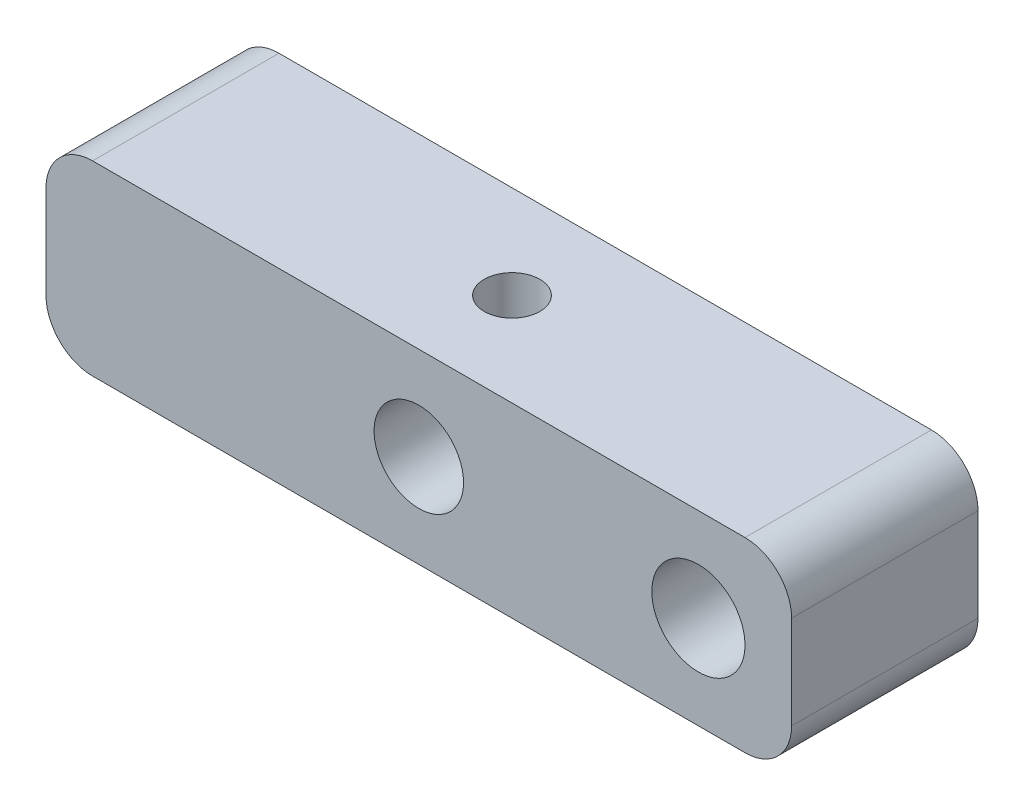
ISO-10303-21;
HEADER;
FILE_DESCRIPTION(('STEP AP214'),'2;1');
FILE_NAME('part.step','',(''),(''),'','','');
FILE_SCHEMA(('AUTOMOTIVE_DESIGN { 1 0 10303 214 1 1 1 1 }'));
ENDSEC;
DATA;
#1=APPLICATION_CONTEXT('core data for automotive mechanical design processes');
#2=APPLICATION_PROTOCOL_DEFINITION('international standard','automotive_design',2000,#1);
#3=PRODUCT_CONTEXT('',#1,'mechanical');
#4=PRODUCT('Part','Part','',(#3));
#5=PRODUCT_RELATED_PRODUCT_CATEGORY('part','',(#4));
#6=PRODUCT_DEFINITION_FORMATION('','',#4);
#7=PRODUCT_DEFINITION_CONTEXT('part definition',#1,'design');
#8=PRODUCT_DEFINITION('design','',#6,#7);
#9=PRODUCT_DEFINITION_SHAPE('','',#8);
#10=(LENGTH_UNIT() NAMED_UNIT(*) SI_UNIT(.MILLI.,.METRE.));
#11=(NAMED_UNIT(*) PLANE_ANGLE_UNIT() SI_UNIT($,.RADIAN.));
#12=(NAMED_UNIT(*) SI_UNIT($,.STERADIAN.) SOLID_ANGLE_UNIT());
#13=UNCERTAINTY_MEASURE_WITH_UNIT(LENGTH_MEASURE(1.E-05),#10,'distance_accuracy_value','');
#14=(GEOMETRIC_REPRESENTATION_CONTEXT(3) GLOBAL_UNCERTAINTY_ASSIGNED_CONTEXT((#13)) GLOBAL_UNIT_ASSIGNED_CONTEXT((#10,
#11,#12)) REPRESENTATION_CONTEXT('',''));
#15=CARTESIAN_POINT('',(0.,0.,0.));
#16=DIRECTION('',(0.,0.,1.));
#17=DIRECTION('',(1.,0.,0.));
#18=AXIS2_PLACEMENT_3D('',#15,#16,#17);
#19=CARTESIAN_POINT('',(-25.4,-6.35,12.7));
#20=DIRECTION('',(1.,0.,0.));
#21=DIRECTION('',(0.,0.,-1.));
#22=AXIS2_PLACEMENT_3D('',#19,#20,#21);
#23=PLANE('',#22);
#24=DIRECTION('',(0.,-1.,0.));
#25=VECTOR('',#24,1.);
#26=CARTESIAN_POINT('',(-25.4,-6.35,12.7));
#27=LINE('',#26,#25);
#28=CARTESIAN_POINT('',(-25.4,3.175,12.7));
#29=VERTEX_POINT('',#28);
#30=CARTESIAN_POINT('',(-25.4,-3.175,12.7));
#31=VERTEX_POINT('',#30);
#32=EDGE_CURVE('E121',#29,#31,#27,.T.);
#33=ORIENTED_EDGE('',*,*,#32,.F.);
#34=DIRECTION('',(0.,0.,-1.));
#35=VECTOR('',#34,1.);
#36=CARTESIAN_POINT('',(-25.4,3.175,12.7));
#37=LINE('',#36,#35);
#38=CARTESIAN_POINT('',(-25.4,3.175,0.));
#39=VERTEX_POINT('',#38);
#40=EDGE_CURVE('E106',#29,#39,#37,.T.);
#41=ORIENTED_EDGE('',*,*,#40,.T.);
#42=DIRECTION('',(0.,-1.,0.));
#43=VECTOR('',#42,1.);
#44=CARTESIAN_POINT('',(-25.4,-6.35,0.));
#45=LINE('',#44,#43);
#46=CARTESIAN_POINT('',(-25.4,-3.175,0.));
#47=VERTEX_POINT('',#46);
#48=EDGE_CURVE('E118',#39,#47,#45,.T.);
#49=ORIENTED_EDGE('',*,*,#48,.T.);
#50=DIRECTION('',(0.,0.,-1.));
#51=VECTOR('',#50,1.);
#52=CARTESIAN_POINT('',(-25.4,-3.175,12.7));
#53=LINE('',#52,#51);
#54=EDGE_CURVE('E123',#47,#31,#53,.F.);
#55=ORIENTED_EDGE('',*,*,#54,.T.);
#56=EDGE_LOOP('',(#33,#41,#49,#55));
#57=FACE_BOUND('',#56,.T.);
#58=ADVANCED_FACE('F36',(#57),#23,.F.);
#59=CARTESIAN_POINT('',(25.4,-6.35,12.7));
#60=DIRECTION('',(0.,1.,0.));
#61=DIRECTION('',(-1.,0.,0.));
#62=AXIS2_PLACEMENT_3D('',#59,#60,#61);
#63=PLANE('',#62);
#64=DIRECTION('',(1.,0.,0.));
#65=VECTOR('',#64,1.);
#66=CARTESIAN_POINT('',(25.4,-6.35,12.7));
#67=LINE('',#66,#65);
#68=CARTESIAN_POINT('',(-22.225,-6.35,12.7));
#69=VERTEX_POINT('',#68);
#70=CARTESIAN_POINT('',(22.225,-6.35,12.7));
#71=VERTEX_POINT('',#70);
#72=EDGE_CURVE('E171',#69,#71,#67,.T.);
#73=ORIENTED_EDGE('',*,*,#72,.F.);
#74=DIRECTION('',(0.,0.,-1.));
#75=VECTOR('',#74,1.);
#76=CARTESIAN_POINT('',(-22.225,-6.35,12.7));
#77=LINE('',#76,#75);
#78=CARTESIAN_POINT('',(-22.225,-6.35,0.));
#79=VERTEX_POINT('',#78);
#80=EDGE_CURVE('E164',#69,#79,#77,.T.);
#81=ORIENTED_EDGE('',*,*,#80,.T.);
#82=DIRECTION('',(1.,0.,0.));
#83=VECTOR('',#82,1.);
#84=CARTESIAN_POINT('',(25.4,-6.35,0.));
#85=LINE('',#84,#83);
#86=CARTESIAN_POINT('',(22.225,-6.35,0.));
#87=VERTEX_POINT('',#86);
#88=EDGE_CURVE('E127',#79,#87,#85,.T.);
#89=ORIENTED_EDGE('',*,*,#88,.T.);
#90=DIRECTION('',(0.,0.,-1.));
#91=VECTOR('',#90,1.);
#92=CARTESIAN_POINT('',(22.225,-6.35,12.7));
#93=LINE('',#92,#91);
#94=EDGE_CURVE('E162',#87,#71,#93,.F.);
#95=ORIENTED_EDGE('',*,*,#94,.T.);
#96=EDGE_LOOP('',(#73,#81,#89,#95));
#97=FACE_BOUND('',#96,.T.);
#98=ADVANCED_FACE('F169',(#97),#63,.F.);
#99=CARTESIAN_POINT('',(25.4,-6.35,12.7));
#100=DIRECTION('',(-1.,0.,0.));
#101=DIRECTION('',(0.,0.,1.));
#102=AXIS2_PLACEMENT_3D('',#99,#100,#101);
#103=PLANE('',#102);
#104=DIRECTION('',(0.,1.,0.));
#105=VECTOR('',#104,1.);
#106=CARTESIAN_POINT('',(25.4,-6.35,12.7));
#107=LINE('',#106,#105);
#108=CARTESIAN_POINT('',(25.4,-3.175,12.7));
#109=VERTEX_POINT('',#108);
#110=CARTESIAN_POINT('',(25.4,3.175,12.7));
#111=VERTEX_POINT('',#110);
#112=EDGE_CURVE('E179',#109,#111,#107,.T.);
#113=ORIENTED_EDGE('',*,*,#112,.F.);
#114=DIRECTION('',(0.,0.,-1.));
#115=VECTOR('',#114,1.);
#116=CARTESIAN_POINT('',(25.4,-3.175,12.7));
#117=LINE('',#116,#115);
#118=CARTESIAN_POINT('',(25.4,-3.175,0.));
#119=VERTEX_POINT('',#118);
#120=EDGE_CURVE('E11',#109,#119,#117,.T.);
#121=ORIENTED_EDGE('',*,*,#120,.T.);
#122=DIRECTION('',(0.,1.,0.));
#123=VECTOR('',#122,1.);
#124=CARTESIAN_POINT('',(25.4,-6.35,0.));
#125=LINE('',#124,#123);
#126=CARTESIAN_POINT('',(25.4,3.175,0.));
#127=VERTEX_POINT('',#126);
#128=EDGE_CURVE('E131',#119,#127,#125,.T.);
#129=ORIENTED_EDGE('',*,*,#128,.T.);
#130=DIRECTION('',(0.,0.,-1.));
#131=VECTOR('',#130,1.);
#132=CARTESIAN_POINT('',(25.4,3.175,12.7));
#133=LINE('',#132,#131);
#134=EDGE_CURVE('E44',#127,#111,#133,.F.);
#135=ORIENTED_EDGE('',*,*,#134,.T.);
#136=EDGE_LOOP('',(#113,#121,#129,#135));
#137=FACE_BOUND('',#136,.T.);
#138=ADVANCED_FACE('F178',(#137),#103,.F.);
#139=CARTESIAN_POINT('',(25.4,6.35,12.7));
#140=DIRECTION('',(0.,-1.,0.));
#141=DIRECTION('',(1.,0.,0.));
#142=AXIS2_PLACEMENT_3D('',#139,#140,#141);
#143=PLANE('',#142);
#144=CARTESIAN_POINT('',(0.,6.35,6.35));
#145=DIRECTION('',(0.,1.,0.));
#146=DIRECTION('',(0.,0.,1.));
#147=AXIS2_PLACEMENT_3D('',#144,#145,#146);
#148=CIRCLE('',#147,1.89865);
#149=CARTESIAN_POINT('',(0.,6.35,8.24865));
#150=VERTEX_POINT('',#149);
#151=EDGE_CURVE('E197',#150,#150,#148,.T.);
#152=ORIENTED_EDGE('',*,*,#151,.F.);
#153=EDGE_LOOP('',(#152));
#154=FACE_BOUND('',#153,.T.);
#155=DIRECTION('',(-1.,0.,0.));
#156=VECTOR('',#155,1.);
#157=CARTESIAN_POINT('',(25.4,6.35,0.));
#158=LINE('',#157,#156);
#159=CARTESIAN_POINT('',(22.225,6.35,0.));
#160=VERTEX_POINT('',#159);
#161=CARTESIAN_POINT('',(-22.225,6.35,0.));
#162=VERTEX_POINT('',#161);
#163=EDGE_CURVE('E141',#160,#162,#158,.T.);
#164=ORIENTED_EDGE('',*,*,#163,.T.);
#165=DIRECTION('',(0.,0.,-1.));
#166=VECTOR('',#165,1.);
#167=CARTESIAN_POINT('',(-22.225,6.35,12.7));
#168=LINE('',#167,#166);
#169=CARTESIAN_POINT('',(-22.225,6.35,12.7));
#170=VERTEX_POINT('',#169);
#171=EDGE_CURVE('E107',#162,#170,#168,.F.);
#172=ORIENTED_EDGE('',*,*,#171,.T.);
#173=DIRECTION('',(-1.,0.,0.));
#174=VECTOR('',#173,1.);
#175=CARTESIAN_POINT('',(25.4,6.35,12.7));
#176=LINE('',#175,#174);
#177=CARTESIAN_POINT('',(22.225,6.35,12.7));
#178=VERTEX_POINT('',#177);
#179=EDGE_CURVE('E137',#178,#170,#176,.T.);
#180=ORIENTED_EDGE('',*,*,#179,.F.);
#181=DIRECTION('',(0.,0.,-1.));
#182=VECTOR('',#181,1.);
#183=CARTESIAN_POINT('',(22.225,6.35,12.7));
#184=LINE('',#183,#182);
#185=EDGE_CURVE('E112',#178,#160,#184,.T.);
#186=ORIENTED_EDGE('',*,*,#185,.T.);
#187=EDGE_LOOP('',(#164,#172,#180,#186));
#188=FACE_BOUND('',#187,.T.);
#189=ADVANCED_FACE('F235',(#154,#188),#143,.F.);
#190=CARTESIAN_POINT('',(0.,0.,12.7));
#191=DIRECTION('',(0.,0.,1.));
#192=DIRECTION('',(1.,0.,0.));
#193=AXIS2_PLACEMENT_3D('',#190,#191,#192);
#194=PLANE('',#193);
#195=CARTESIAN_POINT('',(19.05,0.,12.7));
#196=DIRECTION('',(0.,0.,1.));
#197=DIRECTION('',(1.,0.,0.));
#198=AXIS2_PLACEMENT_3D('',#195,#196,#197);
#199=CIRCLE('',#198,3.175);
#200=CARTESIAN_POINT('',(22.225,0.,12.7));
#201=VERTEX_POINT('',#200);
#202=EDGE_CURVE('E146',#201,#201,#199,.T.);
#203=ORIENTED_EDGE('',*,*,#202,.F.);
#204=EDGE_LOOP('',(#203));
#205=FACE_BOUND('',#204,.T.);
#206=CARTESIAN_POINT('',(0.,0.,12.7));
#207=DIRECTION('',(0.,0.,1.));
#208=DIRECTION('',(1.,0.,0.));
#209=AXIS2_PLACEMENT_3D('',#206,#207,#208);
#210=CIRCLE('',#209,3.048);
#211=CARTESIAN_POINT('',(3.04800000000001,0.,12.7));
#212=VERTEX_POINT('',#211);
#213=EDGE_CURVE('E134',#212,#212,#210,.T.);
#214=ORIENTED_EDGE('',*,*,#213,.F.);
#215=EDGE_LOOP('',(#214));
#216=FACE_BOUND('',#215,.T.);
#217=ORIENTED_EDGE('',*,*,#179,.T.);
#218=CARTESIAN_POINT('',(-22.225,3.175,12.7));
#219=DIRECTION('',(0.,0.,1.));
#220=DIRECTION('',(1.,0.,0.));
#221=AXIS2_PLACEMENT_3D('',#218,#219,#220);
#222=CIRCLE('',#221,3.175);
#223=EDGE_CURVE('E160',#170,#29,#222,.T.);
#224=ORIENTED_EDGE('',*,*,#223,.T.);
#225=ORIENTED_EDGE('',*,*,#32,.T.);
#226=CARTESIAN_POINT('',(-22.225,-3.175,12.7));
#227=DIRECTION('',(0.,0.,1.));
#228=DIRECTION('',(1.,0.,0.));
#229=AXIS2_PLACEMENT_3D('',#226,#227,#228);
#230=CIRCLE('',#229,3.175);
#231=EDGE_CURVE('E158',#31,#69,#230,.T.);
#232=ORIENTED_EDGE('',*,*,#231,.T.);
#233=ORIENTED_EDGE('',*,*,#72,.T.);
#234=CARTESIAN_POINT('',(22.225,-3.175,12.7));
#235=DIRECTION('',(0.,0.,1.));
#236=DIRECTION('',(1.,0.,0.));
#237=AXIS2_PLACEMENT_3D('',#234,#235,#236);
#238=CIRCLE('',#237,3.175);
#239=EDGE_CURVE('E57',#71,#109,#238,.T.);
#240=ORIENTED_EDGE('',*,*,#239,.T.);
#241=ORIENTED_EDGE('',*,*,#112,.T.);
#242=CARTESIAN_POINT('',(22.225,3.175,12.7));
#243=DIRECTION('',(0.,0.,1.));
#244=DIRECTION('',(1.,0.,0.));
#245=AXIS2_PLACEMENT_3D('',#242,#243,#244);
#246=CIRCLE('',#245,3.175);
#247=EDGE_CURVE('E155',#111,#178,#246,.T.);
#248=ORIENTED_EDGE('',*,*,#247,.T.);
#249=EDGE_LOOP('',(#217,#224,#225,#232,#233,#240,#241,#248));
#250=FACE_BOUND('',#249,.T.);
#251=ADVANCED_FACE('F233',(#205,#216,#250),#194,.T.);
#252=CARTESIAN_POINT('',(0.,0.,0.));
#253=DIRECTION('',(0.,0.,1.));
#254=DIRECTION('',(1.,0.,0.));
#255=AXIS2_PLACEMENT_3D('',#252,#253,#254);
#256=PLANE('',#255);
#257=CARTESIAN_POINT('',(19.05,0.,0.));
#258=DIRECTION('',(0.,0.,1.));
#259=DIRECTION('',(1.,0.,0.));
#260=AXIS2_PLACEMENT_3D('',#257,#258,#259);
#261=CIRCLE('',#260,3.175);
#262=CARTESIAN_POINT('',(22.225,0.,0.));
#263=VERTEX_POINT('',#262);
#264=EDGE_CURVE('E143',#263,#263,#261,.T.);
#265=ORIENTED_EDGE('',*,*,#264,.T.);
#266=EDGE_LOOP('',(#265));
#267=FACE_BOUND('',#266,.T.);
#268=CARTESIAN_POINT('',(0.,0.,0.));
#269=DIRECTION('',(0.,0.,1.));
#270=DIRECTION('',(1.,0.,0.));
#271=AXIS2_PLACEMENT_3D('',#268,#269,#270);
#272=CIRCLE('',#271,3.048);
#273=CARTESIAN_POINT('',(3.04800000000001,0.,0.));
#274=VERTEX_POINT('',#273);
#275=EDGE_CURVE('E128',#274,#274,#272,.T.);
#276=ORIENTED_EDGE('',*,*,#275,.T.);
#277=EDGE_LOOP('',(#276));
#278=FACE_BOUND('',#277,.T.);
#279=ORIENTED_EDGE('',*,*,#48,.F.);
#280=CARTESIAN_POINT('',(-22.225,3.175,0.));
#281=DIRECTION('',(0.,0.,1.));
#282=DIRECTION('',(1.,0.,0.));
#283=AXIS2_PLACEMENT_3D('',#280,#281,#282);
#284=CIRCLE('',#283,3.175);
#285=EDGE_CURVE('E102',#39,#162,#284,.F.);
#286=ORIENTED_EDGE('',*,*,#285,.T.);
#287=ORIENTED_EDGE('',*,*,#163,.F.);
#288=CARTESIAN_POINT('',(22.225,3.175,0.));
#289=DIRECTION('',(0.,0.,1.));
#290=DIRECTION('',(1.,0.,0.));
#291=AXIS2_PLACEMENT_3D('',#288,#289,#290);
#292=CIRCLE('',#291,3.175);
#293=EDGE_CURVE('E122',#160,#127,#292,.F.);
#294=ORIENTED_EDGE('',*,*,#293,.T.);
#295=ORIENTED_EDGE('',*,*,#128,.F.);
#296=CARTESIAN_POINT('',(22.225,-3.175,0.));
#297=DIRECTION('',(0.,0.,1.));
#298=DIRECTION('',(1.,0.,0.));
#299=AXIS2_PLACEMENT_3D('',#296,#297,#298);
#300=CIRCLE('',#299,3.175);
#301=EDGE_CURVE('E149',#119,#87,#300,.F.);
#302=ORIENTED_EDGE('',*,*,#301,.T.);
#303=ORIENTED_EDGE('',*,*,#88,.F.);
#304=CARTESIAN_POINT('',(-22.225,-3.175,0.));
#305=DIRECTION('',(0.,0.,1.));
#306=DIRECTION('',(1.,0.,0.));
#307=AXIS2_PLACEMENT_3D('',#304,#305,#306);
#308=CIRCLE('',#307,3.175);
#309=EDGE_CURVE('E113',#79,#47,#308,.F.);
#310=ORIENTED_EDGE('',*,*,#309,.T.);
#311=EDGE_LOOP('',(#279,#286,#287,#294,#295,#302,#303,#310));
#312=FACE_BOUND('',#311,.T.);
#313=ADVANCED_FACE('F125',(#267,#278,#312),#256,.F.);
#314=CARTESIAN_POINT('',(0.,0.,-38.1));
#315=DIRECTION('',(0.,0.,1.));
#316=DIRECTION('',(1.,0.,0.));
#317=AXIS2_PLACEMENT_3D('',#314,#315,#316);
#318=CYLINDRICAL_SURFACE('',#317,3.048);
#319=CARTESIAN_POINT('',(0.,3.04799999999999,8.24865));
#320=CARTESIAN_POINT('',(0.0965199754628851,3.04799287386473,8.24864222186036));
#321=CARTESIAN_POINT('',(0.193162258403823,3.04336673550244,8.24123933280617));
#322=CARTESIAN_POINT('',(0.383485571379036,3.02529814587099,8.21202121048374));
#323=CARTESIAN_POINT('',(0.477160438595041,3.0118384653262,8.19017781128725));
#324=CARTESIAN_POINT('',(0.658420390425057,2.97745801800553,8.13334860361373));
#325=CARTESIAN_POINT('',(0.746033121729853,2.9565742157917,8.09842786177201));
#326=CARTESIAN_POINT('',(0.913854188489604,2.90908773447562,8.01687028110771));
#327=CARTESIAN_POINT('',(0.994063424163142,2.88248575198107,7.97023486928851));
#328=CARTESIAN_POINT('',(1.15202079748487,2.82326397026106,7.86247384082135));
#329=CARTESIAN_POINT('',(1.22906501006091,2.790333730293,7.80049038465319));
#330=CARTESIAN_POINT('',(1.37234771900989,2.72272965183658,7.66575962899557));
#331=CARTESIAN_POINT('',(1.43857149649327,2.68805352089386,7.59299792017288));
#332=CARTESIAN_POINT('',(1.56738582919592,2.61529638997195,7.42732199006565));
#333=CARTESIAN_POINT('',(1.62829293384863,2.57738384541102,7.33301362213063));
#334=CARTESIAN_POINT('',(1.73320901956297,2.50803851294694,7.13327968941133));
#335=CARTESIAN_POINT('',(1.77724646142739,2.47659485326428,7.02787323475238));
#336=CARTESIAN_POINT('',(1.83723583210458,2.43225942613685,6.83655167324727));
#337=CARTESIAN_POINT('',(1.85750145128755,2.41667474834948,6.75261716637633));
#338=CARTESIAN_POINT('',(1.88644666261499,2.3941535053659,6.58168549797418));
#339=CARTESIAN_POINT('',(1.89514244685425,2.3872048548668,6.49469279192548));
#340=CARTESIAN_POINT('',(1.90042892515628,2.38299996020863,6.31987288440127));
#341=CARTESIAN_POINT('',(1.89698860851939,2.38576854586845,6.23204411786474));
#342=CARTESIAN_POINT('',(1.87816657168478,2.40060997549857,6.05845536526028));
#343=CARTESIAN_POINT('',(1.86277532450302,2.41269024245315,5.9726970859968));
#344=CARTESIAN_POINT('',(1.82139234632706,2.44407055717438,5.80730349112785));
#345=CARTESIAN_POINT('',(1.79564062319011,2.46320637114049,5.72757511349579));
#346=CARTESIAN_POINT('',(1.7345465540449,2.50660192552348,5.57340173077806));
#347=CARTESIAN_POINT('',(1.69920080726618,2.5308634821728,5.49895861097185));
#348=CARTESIAN_POINT('',(1.61237037171611,2.58722086012322,5.34275856830748));
#349=CARTESIAN_POINT('',(1.55910711021895,2.61993467982087,5.26221365920818));
#350=CARTESIAN_POINT('',(1.44129530392798,2.68655204712836,5.11032577929887));
#351=CARTESIAN_POINT('',(1.3767352173478,2.72045678288594,5.03899235052021));
#352=CARTESIAN_POINT('',(1.2257472223204,2.79211578341382,4.89572003897594));
#353=CARTESIAN_POINT('',(1.13747038077364,2.82959863622149,4.82557165500514));
#354=CARTESIAN_POINT('',(0.948191512028885,2.89851016958695,4.70118051721925));
#355=CARTESIAN_POINT('',(0.847194690529222,2.92994131359687,4.64693128666456));
#356=CARTESIAN_POINT('',(0.640677680176812,2.98169881755271,4.55939378595609));
#357=CARTESIAN_POINT('',(0.535711521314332,3.0025407290156,4.52511702647823));
#358=CARTESIAN_POINT('',(0.319921311661777,3.03311239317562,4.47523706281334));
#359=CARTESIAN_POINT('',(0.209105670450559,3.04285766706966,4.45960777438644));
#360=CARTESIAN_POINT('',(0.00256564965420741,3.04948755866532,4.44896167772391));
#361=CARTESIAN_POINT('',(-0.0929762563735373,3.04805568363605,4.45124683710297));
#362=CARTESIAN_POINT('',(-0.282096052068984,3.03639472416005,4.47002215177299));
#363=CARTESIAN_POINT('',(-0.375674065929843,3.02616619772608,4.48651140603187));
#364=CARTESIAN_POINT('',(-0.554720709520461,2.99841614753911,4.53193124320656));
#365=CARTESIAN_POINT('',(-0.640362156235548,2.98118483827363,4.5603681119168));
#366=CARTESIAN_POINT('',(-0.805575731327887,2.94084856489841,4.62839977988254));
#367=CARTESIAN_POINT('',(-0.885146827487968,2.9177426047301,4.66799647143152));
#368=CARTESIAN_POINT('',(-1.04470715485489,2.86472618079875,4.7616471069901));
#369=CARTESIAN_POINT('',(-1.12392263537415,2.8343635846682,4.81675906701229));
#370=CARTESIAN_POINT('',(-1.27254169378619,2.7708281827398,4.93766016880511));
#371=CARTESIAN_POINT('',(-1.34193414057798,2.737652255955,5.00346124468219));
#372=CARTESIAN_POINT('',(-1.47929381029039,2.66623471487764,5.15481682386282));
#373=CARTESIAN_POINT('',(-1.54561674307914,2.62795160614164,5.24185137470699));
#374=CARTESIAN_POINT('',(-1.66292757054318,2.5553349364001,5.42720532108179));
#375=CARTESIAN_POINT('',(-1.71392659953363,2.52099851899315,5.52551645095672));
#376=CARTESIAN_POINT('',(-1.78974560999086,2.46754941786874,5.7101329984771));
#377=CARTESIAN_POINT('',(-1.81781659712059,2.44675357781812,5.79460882926712));
#378=CARTESIAN_POINT('',(-1.86199881397002,2.41330552880838,5.96813672241466));
#379=CARTESIAN_POINT('',(-1.87812858959831,2.40064069565366,6.05718145779839));
#380=CARTESIAN_POINT('',(-1.89753800184264,2.38533443380439,6.23806031537403));
#381=CARTESIAN_POINT('',(-1.90074643064242,2.38274855136794,6.32990709171944));
#382=CARTESIAN_POINT('',(-1.89387111104784,2.38821505247373,6.51279891724441));
#383=CARTESIAN_POINT('',(-1.88378262351127,2.39627122894507,6.60384366893044));
#384=CARTESIAN_POINT('',(-1.85230271386269,2.42066638505345,6.77527359701759));
#385=CARTESIAN_POINT('',(-1.83184932969752,2.43631397362741,6.8559376583164));
#386=CARTESIAN_POINT('',(-1.7811686415483,2.47360630576442,7.01264628634909));
#387=CARTESIAN_POINT('',(-1.750937318606,2.49525351478533,7.08868893828405));
#388=CARTESIAN_POINT('',(-1.67653206487791,2.54594723197745,7.24596136194233));
#389=CARTESIAN_POINT('',(-1.63096780705239,2.5756124193532,7.32633045981423));
#390=CARTESIAN_POINT('',(-1.52922136971404,2.63729659389152,7.47906538810445));
#391=CARTESIAN_POINT('',(-1.47303055609089,2.66931748205127,7.55142463416834));
#392=CARTESIAN_POINT('',(-1.33882480510753,2.73945889940576,7.70068672382497));
#393=CARTESIAN_POINT('',(-1.25869084710263,2.77754957327792,7.77571784461429));
#394=CARTESIAN_POINT('',(-1.08550582165336,2.84970179823474,7.91162701000299));
#395=CARTESIAN_POINT('',(-0.992447121710628,2.88376094639083,7.97249663452001));
#396=CARTESIAN_POINT('',(-0.795117092884284,2.9442601891883,8.07774240672682));
#397=CARTESIAN_POINT('',(-0.690860681626829,2.97071025194058,8.12214015533018));
#398=CARTESIAN_POINT('',(-0.528614072018153,3.00232025190951,8.17446638703747));
#399=CARTESIAN_POINT('',(-0.473609752470336,3.01150783746529,8.18952253524507));
#400=CARTESIAN_POINT('',(-0.362089408657569,3.02693756924071,8.21467700250555));
#401=CARTESIAN_POINT('',(-0.305574545128343,3.03318191204712,8.22477901913056));
#402=CARTESIAN_POINT('',(-0.207491883882577,3.04120944052532,8.23773409576822));
#403=CARTESIAN_POINT('',(-0.166143862827478,3.04375068049844,8.24182236812766));
#404=CARTESIAN_POINT('',(-0.0832048160637374,3.04714754857923,8.24728208104848));
#405=CARTESIAN_POINT('',(-0.0416137754765415,3.04800307237327,8.24865335347947));
#406=CARTESIAN_POINT('',(0.,3.04799999999999,8.24865));
#407=B_SPLINE_CURVE_WITH_KNOTS('',3,(#319,#320,#321,#322,#323,#324,#325,#326,#327,#328,#329,
#330,#331,#332,#333,#334,#335,#336,#337,#338,#339,#340,#341,#342,#343,#344,#345,#346,#347,#348,
#349,#350,#351,#352,#353,#354,#355,#356,#357,#358,#359,#360,#361,#362,#363,#364,#365,#366,#367,
#368,#369,#370,#371,#372,#373,#374,#375,#376,#377,#378,#379,#380,#381,#382,#383,#384,#385,#386,
#387,#388,#389,#390,#391,#392,#393,#394,#395,#396,#397,#398,#399,#400,#401,#402,#403,#404,#405,
#406),.UNSPECIFIED.,.T.,.F.,(4,2,2,2,2,2,2,2,2,2,2,2,2,2,2,2,2,2,2,2,2,2,2,2,2,2,2,2,2,2,2,2,2,
2,2,2,2,2,2,2,2,2,2,4),(0.,0.289392237799233,0.579350601378708,0.867885034878797,
1.15638433805796,1.46784445612606,1.77972478404096,2.1335061336411,2.48668796223778,
2.74881882719106,3.01058245025209,3.27301542721917,3.53565782426839,3.79253727748119,
4.04950790531415,4.35423655127278,4.65927837110496,5.0139601862005,5.36849731529251,
5.70354103981927,6.03811555082853,6.32338785529394,6.60864206493712,6.88311634390205,
7.15763719158972,7.45995955005835,7.7626217928043,8.10886932267089,8.45486465805797,
8.72802092790243,9.00075206329256,9.27498414369734,9.54931398935017,9.80235200668146,
10.0554941609219,10.345551423508,10.6358453790229,10.9828233956632,11.3300071927685,
11.676734076537,11.8497699294398,12.0226764377777,12.1474377465825,12.2722067754874),.UNSPECIFIED.);
#408=CARTESIAN_POINT('',(0.,3.04799999999999,8.24865));
#409=VERTEX_POINT('',#408);
#410=EDGE_CURVE('E189',#409,#409,#407,.T.);
#411=ORIENTED_EDGE('',*,*,#410,.T.);
#412=EDGE_LOOP('',(#411));
#413=FACE_BOUND('',#412,.T.);
#414=ORIENTED_EDGE('',*,*,#213,.T.);
#415=EDGE_LOOP('',(#414));
#416=FACE_BOUND('',#415,.T.);
#417=ORIENTED_EDGE('',*,*,#275,.F.);
#418=EDGE_LOOP('',(#417));
#419=FACE_BOUND('',#418,.T.);
#420=ADVANCED_FACE('F211',(#413,#416,#419),#318,.F.);
#421=CARTESIAN_POINT('',(19.05,0.,-38.1));
#422=DIRECTION('',(0.,0.,1.));
#423=DIRECTION('',(1.,0.,0.));
#424=AXIS2_PLACEMENT_3D('',#421,#422,#423);
#425=CYLINDRICAL_SURFACE('',#424,3.175);
#426=ORIENTED_EDGE('',*,*,#202,.T.);
#427=EDGE_LOOP('',(#426));
#428=FACE_BOUND('',#427,.T.);
#429=ORIENTED_EDGE('',*,*,#264,.F.);
#430=EDGE_LOOP('',(#429));
#431=FACE_BOUND('',#430,.T.);
#432=ADVANCED_FACE('F203',(#428,#431),#425,.F.);
#433=CARTESIAN_POINT('',(0.,6.35,6.35));
#434=DIRECTION('',(0.,1.,0.));
#435=DIRECTION('',(0.,0.,1.));
#436=AXIS2_PLACEMENT_3D('',#433,#434,#435);
#437=CYLINDRICAL_SURFACE('',#436,1.89865);
#438=ORIENTED_EDGE('',*,*,#410,.F.);
#439=EDGE_LOOP('',(#438));
#440=FACE_BOUND('',#439,.T.);
#441=ORIENTED_EDGE('',*,*,#151,.T.);
#442=EDGE_LOOP('',(#441));
#443=FACE_BOUND('',#442,.T.);
#444=ADVANCED_FACE('F200',(#440,#443),#437,.F.);
#445=CARTESIAN_POINT('',(-22.225,3.175,12.7));
#446=DIRECTION('',(0.,0.,-1.));
#447=DIRECTION('',(-1.,0.,0.));
#448=AXIS2_PLACEMENT_3D('',#445,#446,#447);
#449=CYLINDRICAL_SURFACE('',#448,3.175);
#450=ORIENTED_EDGE('',*,*,#223,.F.);
#451=ORIENTED_EDGE('',*,*,#171,.F.);
#452=ORIENTED_EDGE('',*,*,#285,.F.);
#453=ORIENTED_EDGE('',*,*,#40,.F.);
#454=EDGE_LOOP('',(#450,#451,#452,#453));
#455=FACE_BOUND('',#454,.T.);
#456=ADVANCED_FACE('F105',(#455),#449,.T.);
#457=CARTESIAN_POINT('',(-22.225,-3.175,12.7));
#458=DIRECTION('',(0.,0.,-1.));
#459=DIRECTION('',(-1.,0.,0.));
#460=AXIS2_PLACEMENT_3D('',#457,#458,#459);
#461=CYLINDRICAL_SURFACE('',#460,3.175);
#462=ORIENTED_EDGE('',*,*,#231,.F.);
#463=ORIENTED_EDGE('',*,*,#54,.F.);
#464=ORIENTED_EDGE('',*,*,#309,.F.);
#465=ORIENTED_EDGE('',*,*,#80,.F.);
#466=EDGE_LOOP('',(#462,#463,#464,#465));
#467=FACE_BOUND('',#466,.T.);
#468=ADVANCED_FACE('F209',(#467),#461,.T.);
#469=CARTESIAN_POINT('',(22.225,-3.175,12.7));
#470=DIRECTION('',(0.,0.,-1.));
#471=DIRECTION('',(-1.,0.,0.));
#472=AXIS2_PLACEMENT_3D('',#469,#470,#471);
#473=CYLINDRICAL_SURFACE('',#472,3.175);
#474=ORIENTED_EDGE('',*,*,#239,.F.);
#475=ORIENTED_EDGE('',*,*,#94,.F.);
#476=ORIENTED_EDGE('',*,*,#301,.F.);
#477=ORIENTED_EDGE('',*,*,#120,.F.);
#478=EDGE_LOOP('',(#474,#475,#476,#477));
#479=FACE_BOUND('',#478,.T.);
#480=ADVANCED_FACE('F177',(#479),#473,.T.);
#481=CARTESIAN_POINT('',(22.225,3.175,12.7));
#482=DIRECTION('',(0.,0.,-1.));
#483=DIRECTION('',(-1.,0.,0.));
#484=AXIS2_PLACEMENT_3D('',#481,#482,#483);
#485=CYLINDRICAL_SURFACE('',#484,3.175);
#486=ORIENTED_EDGE('',*,*,#247,.F.);
#487=ORIENTED_EDGE('',*,*,#134,.F.);
#488=ORIENTED_EDGE('',*,*,#293,.F.);
#489=ORIENTED_EDGE('',*,*,#185,.F.);
#490=EDGE_LOOP('',(#486,#487,#488,#489));
#491=FACE_BOUND('',#490,.T.);
#492=ADVANCED_FACE('F38',(#491),#485,.T.);
#493=CLOSED_SHELL('',(#58,#98,#138,#189,#251,#313,#420,#432,#444,#456,#468,#480,#492));
#494=MANIFOLD_SOLID_BREP('B2',#493);
#495=ADVANCED_BREP_SHAPE_REPRESENTATION('',(#18,#494),#14);
#496=SHAPE_DEFINITION_REPRESENTATION(#9,#495);
ENDSEC;
END-ISO-10303-21;
